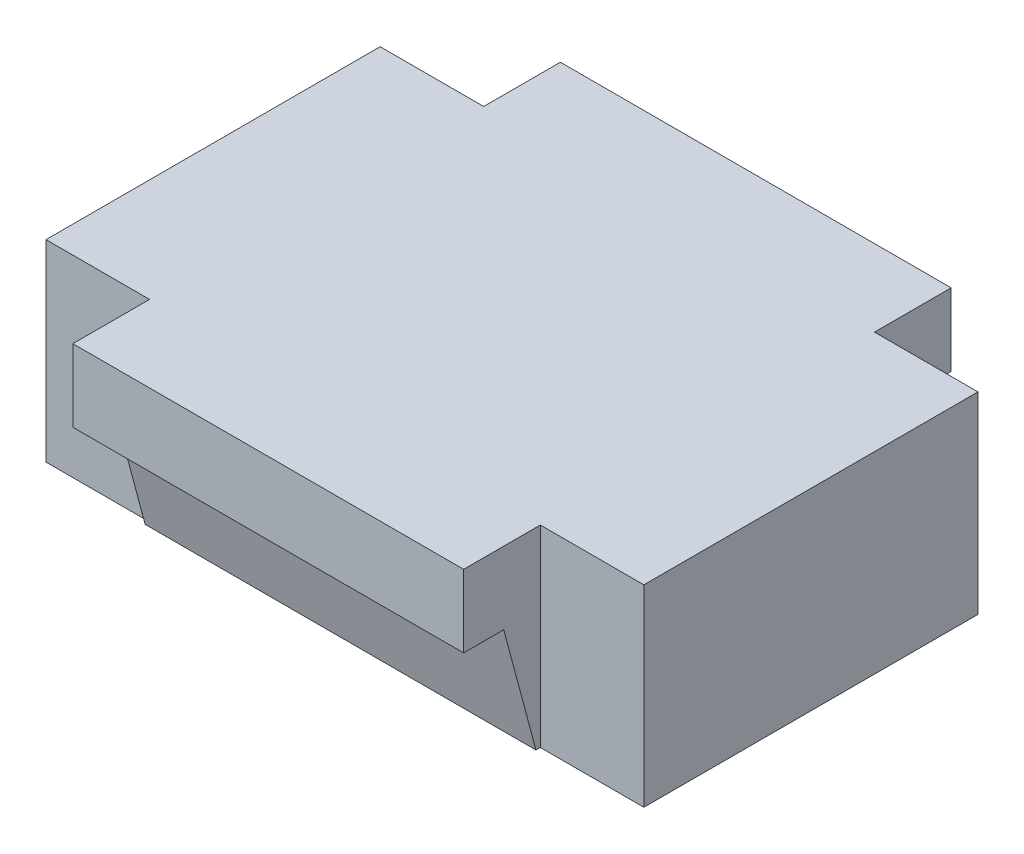
ISO-10303-21;
HEADER;
FILE_DESCRIPTION(('STEP AP214'),'2;1');
FILE_NAME('part.step','',(''),(''),'','','');
FILE_SCHEMA(('AUTOMOTIVE_DESIGN { 1 0 10303 214 1 1 1 1 }'));
ENDSEC;
DATA;
#1=APPLICATION_CONTEXT('core data for automotive mechanical design processes');
#2=APPLICATION_PROTOCOL_DEFINITION('international standard','automotive_design',2000,#1);
#3=PRODUCT_CONTEXT('',#1,'mechanical');
#4=PRODUCT('Part','Part','',(#3));
#5=PRODUCT_RELATED_PRODUCT_CATEGORY('part','',(#4));
#6=PRODUCT_DEFINITION_FORMATION('','',#4);
#7=PRODUCT_DEFINITION_CONTEXT('part definition',#1,'design');
#8=PRODUCT_DEFINITION('design','',#6,#7);
#9=PRODUCT_DEFINITION_SHAPE('','',#8);
#10=(LENGTH_UNIT() NAMED_UNIT(*) SI_UNIT(.MILLI.,.METRE.));
#11=(NAMED_UNIT(*) PLANE_ANGLE_UNIT() SI_UNIT($,.RADIAN.));
#12=(NAMED_UNIT(*) SI_UNIT($,.STERADIAN.) SOLID_ANGLE_UNIT());
#13=UNCERTAINTY_MEASURE_WITH_UNIT(LENGTH_MEASURE(1.E-05),#10,'distance_accuracy_value','');
#14=(GEOMETRIC_REPRESENTATION_CONTEXT(3) GLOBAL_UNCERTAINTY_ASSIGNED_CONTEXT((#13)) GLOBAL_UNIT_ASSIGNED_CONTEXT((#10,
#11,#12)) REPRESENTATION_CONTEXT('',''));
#15=CARTESIAN_POINT('',(0.,0.,0.));
#16=DIRECTION('',(0.,0.,1.));
#17=DIRECTION('',(1.,0.,0.));
#18=AXIS2_PLACEMENT_3D('',#15,#16,#17);
#19=CARTESIAN_POINT('',(25.25,2.66144660940672,9.64644660940669));
#20=DIRECTION('',(1.,0.,0.));
#21=DIRECTION('',(0.,0.,-1.));
#22=AXIS2_PLACEMENT_3D('',#19,#20,#21);
#23=PLANE('',#22);
#24=DIRECTION('',(0.,1.,0.));
#25=VECTOR('',#24,1.);
#26=CARTESIAN_POINT('',(25.25,14.03,-21.59));
#27=LINE('',#26,#25);
#28=CARTESIAN_POINT('',(25.25,-8.9,-21.59));
#29=VERTEX_POINT('',#28);
#30=CARTESIAN_POINT('',(25.25,16.,-21.59));
#31=VERTEX_POINT('',#30);
#32=EDGE_CURVE('E67',#29,#31,#27,.T.);
#33=ORIENTED_EDGE('',*,*,#32,.F.);
#34=DIRECTION('',(0.,0.,1.));
#35=VECTOR('',#34,1.);
#36=CARTESIAN_POINT('',(25.25,-8.9,-20.12));
#37=LINE('',#36,#35);
#38=CARTESIAN_POINT('',(25.25,-8.9,-22.1552761804101));
#39=VERTEX_POINT('',#38);
#40=EDGE_CURVE('E263',#39,#29,#37,.T.);
#41=ORIENTED_EDGE('',*,*,#40,.F.);
#42=DIRECTION('',(0.,-0.965925826289069,0.258819045102518));
#43=VECTOR('',#42,1.);
#44=CARTESIAN_POINT('',(25.25,-7.4857864376269,-22.5342135623731));
#45=LINE('',#44,#43);
#46=CARTESIAN_POINT('',(25.25,6.6442135623731,-26.3203356514248));
#47=VERTEX_POINT('',#46);
#48=EDGE_CURVE('E248',#47,#39,#45,.T.);
#49=ORIENTED_EDGE('',*,*,#48,.F.);
#50=DIRECTION('',(0.,0.,1.));
#51=VECTOR('',#50,1.);
#52=CARTESIAN_POINT('',(25.25,6.6442135623731,-26.3203356514248));
#53=LINE('',#52,#51);
#54=CARTESIAN_POINT('',(25.25,6.6442135623731,-31.5));
#55=VERTEX_POINT('',#54);
#56=EDGE_CURVE('E253',#55,#47,#53,.T.);
#57=ORIENTED_EDGE('',*,*,#56,.F.);
#58=DIRECTION('',(0.,-1.,0.));
#59=VECTOR('',#58,1.);
#60=CARTESIAN_POINT('',(25.25,6.6442135623731,-31.5));
#61=LINE('',#60,#59);
#62=CARTESIAN_POINT('',(25.25,16.,-31.5));
#63=VERTEX_POINT('',#62);
#64=EDGE_CURVE('E257',#63,#55,#61,.T.);
#65=ORIENTED_EDGE('',*,*,#64,.F.);
#66=DIRECTION('',(0.,0.,1.));
#67=VECTOR('',#66,1.);
#68=CARTESIAN_POINT('',(25.25,16.,5.35500000000001));
#69=LINE('',#68,#67);
#70=EDGE_CURVE('E291',#63,#31,#69,.T.);
#71=ORIENTED_EDGE('',*,*,#70,.T.);
#72=EDGE_LOOP('',(#33,#41,#49,#57,#65,#71));
#73=FACE_BOUND('',#72,.T.);
#74=ADVANCED_FACE('F43',(#73),#23,.T.);
#75=CARTESIAN_POINT('',(-25.25,2.66144660940672,9.64644660940669));
#76=DIRECTION('',(-1.,0.,0.));
#77=DIRECTION('',(0.,0.,-1.));
#78=AXIS2_PLACEMENT_3D('',#75,#76,#77);
#79=PLANE('',#78);
#80=DIRECTION('',(0.,1.,0.));
#81=VECTOR('',#80,1.);
#82=CARTESIAN_POINT('',(-25.25,14.03,-21.59));
#83=LINE('',#82,#81);
#84=CARTESIAN_POINT('',(-25.25,-8.9,-21.59));
#85=VERTEX_POINT('',#84);
#86=CARTESIAN_POINT('',(-25.25,16.,-21.59));
#87=VERTEX_POINT('',#86);
#88=EDGE_CURVE('E184',#85,#87,#83,.T.);
#89=ORIENTED_EDGE('',*,*,#88,.T.);
#90=DIRECTION('',(0.,0.,1.));
#91=VECTOR('',#90,1.);
#92=CARTESIAN_POINT('',(-25.25,16.,5.35500000000001));
#93=LINE('',#92,#91);
#94=CARTESIAN_POINT('',(-25.25,16.,-31.5));
#95=VERTEX_POINT('',#94);
#96=EDGE_CURVE('E236',#95,#87,#93,.T.);
#97=ORIENTED_EDGE('',*,*,#96,.F.);
#98=DIRECTION('',(0.,-1.,0.));
#99=VECTOR('',#98,1.);
#100=CARTESIAN_POINT('',(-25.25,6.6442135623731,-31.5));
#101=LINE('',#100,#99);
#102=CARTESIAN_POINT('',(-25.25,6.6442135623731,-31.5));
#103=VERTEX_POINT('',#102);
#104=EDGE_CURVE('E217',#95,#103,#101,.T.);
#105=ORIENTED_EDGE('',*,*,#104,.T.);
#106=DIRECTION('',(0.,0.,1.));
#107=VECTOR('',#106,1.);
#108=CARTESIAN_POINT('',(-25.25,6.6442135623731,-26.3203356514248));
#109=LINE('',#108,#107);
#110=CARTESIAN_POINT('',(-25.25,6.6442135623731,-26.3203356514248));
#111=VERTEX_POINT('',#110);
#112=EDGE_CURVE('E213',#103,#111,#109,.T.);
#113=ORIENTED_EDGE('',*,*,#112,.T.);
#114=DIRECTION('',(0.,-0.965925826289069,0.258819045102518));
#115=VECTOR('',#114,1.);
#116=CARTESIAN_POINT('',(-25.25,-7.4857864376269,-22.5342135623731));
#117=LINE('',#116,#115);
#118=CARTESIAN_POINT('',(-25.25,-8.9,-22.1552761804101));
#119=VERTEX_POINT('',#118);
#120=EDGE_CURVE('E181',#111,#119,#117,.T.);
#121=ORIENTED_EDGE('',*,*,#120,.T.);
#122=DIRECTION('',(0.,0.,1.));
#123=VECTOR('',#122,1.);
#124=CARTESIAN_POINT('',(-25.25,-8.9,-20.12));
#125=LINE('',#124,#123);
#126=EDGE_CURVE('E206',#119,#85,#125,.T.);
#127=ORIENTED_EDGE('',*,*,#126,.T.);
#128=EDGE_LOOP('',(#89,#97,#105,#113,#121,#127));
#129=FACE_BOUND('',#128,.T.);
#130=ADVANCED_FACE('F338',(#129),#79,.T.);
#131=CARTESIAN_POINT('',(38.63,-7.43,21.59));
#132=DIRECTION('',(0.,0.,-1.));
#133=DIRECTION('',(0.,1.,0.));
#134=AXIS2_PLACEMENT_3D('',#131,#132,#133);
#135=PLANE('',#134);
#136=DIRECTION('',(0.,-1.,0.));
#137=VECTOR('',#136,1.);
#138=CARTESIAN_POINT('',(38.63,-7.43,21.59));
#139=LINE('',#138,#137);
#140=CARTESIAN_POINT('',(38.63,16.,21.59));
#141=VERTEX_POINT('',#140);
#142=CARTESIAN_POINT('',(38.63,-8.9,21.59));
#143=VERTEX_POINT('',#142);
#144=EDGE_CURVE('E52',#141,#143,#139,.T.);
#145=ORIENTED_EDGE('',*,*,#144,.F.);
#146=DIRECTION('',(1.,0.,0.));
#147=VECTOR('',#146,1.);
#148=CARTESIAN_POINT('',(-88.4749836994657,16.,21.59));
#149=LINE('',#148,#147);
#150=CARTESIAN_POINT('',(25.25,16.,21.59));
#151=VERTEX_POINT('',#150);
#152=EDGE_CURVE('E324',#151,#141,#149,.T.);
#153=ORIENTED_EDGE('',*,*,#152,.F.);
#154=DIRECTION('',(0.,1.,0.));
#155=VECTOR('',#154,1.);
#156=CARTESIAN_POINT('',(25.25,14.03,21.59));
#157=LINE('',#156,#155);
#158=CARTESIAN_POINT('',(25.25,-8.9,21.59));
#159=VERTEX_POINT('',#158);
#160=EDGE_CURVE('E59',#159,#151,#157,.T.);
#161=ORIENTED_EDGE('',*,*,#160,.F.);
#162=DIRECTION('',(1.,0.,0.));
#163=VECTOR('',#162,1.);
#164=CARTESIAN_POINT('',(-88.4749836994657,-8.9,21.59));
#165=LINE('',#164,#163);
#166=EDGE_CURVE('E201',#159,#143,#165,.T.);
#167=ORIENTED_EDGE('',*,*,#166,.T.);
#168=EDGE_LOOP('',(#145,#153,#161,#167));
#169=FACE_BOUND('',#168,.T.);
#170=ADVANCED_FACE('F45',(#169),#135,.F.);
#171=CARTESIAN_POINT('',(38.63,-8.9,8.23500000000003));
#172=DIRECTION('',(0.,1.,0.));
#173=DIRECTION('',(0.,0.,1.));
#174=AXIS2_PLACEMENT_3D('',#171,#172,#173);
#175=PLANE('',#174);
#176=DIRECTION('',(0.,0.,-1.));
#177=VECTOR('',#176,1.);
#178=CARTESIAN_POINT('',(-25.25,-8.9,20.12));
#179=LINE('',#178,#177);
#180=CARTESIAN_POINT('',(-25.25,-8.90000000000001,22.1552761804101));
#181=VERTEX_POINT('',#180);
#182=CARTESIAN_POINT('',(-25.25,-8.9,21.59));
#183=VERTEX_POINT('',#182);
#184=EDGE_CURVE('E180',#181,#183,#179,.T.);
#185=ORIENTED_EDGE('',*,*,#184,.T.);
#186=CARTESIAN_POINT('',(-38.63,-8.9,21.59));
#187=VERTEX_POINT('',#186);
#188=EDGE_CURVE('E164',#187,#183,#165,.T.);
#189=ORIENTED_EDGE('',*,*,#188,.F.);
#190=DIRECTION('',(0.,0.,-1.));
#191=VECTOR('',#190,1.);
#192=CARTESIAN_POINT('',(-38.63,-8.9,8.23500000000003));
#193=LINE('',#192,#191);
#194=CARTESIAN_POINT('',(-38.63,-8.9,-21.59));
#195=VERTEX_POINT('',#194);
#196=EDGE_CURVE('E157',#187,#195,#193,.T.);
#197=ORIENTED_EDGE('',*,*,#196,.T.);
#198=DIRECTION('',(1.,0.,0.));
#199=VECTOR('',#198,1.);
#200=CARTESIAN_POINT('',(-88.4749836994657,-8.9,-21.59));
#201=LINE('',#200,#199);
#202=EDGE_CURVE('E162',#195,#85,#201,.T.);
#203=ORIENTED_EDGE('',*,*,#202,.T.);
#204=ORIENTED_EDGE('',*,*,#126,.F.);
#205=DIRECTION('',(1.,0.,0.));
#206=VECTOR('',#205,1.);
#207=CARTESIAN_POINT('',(-92.9922320270007,-8.9,-22.1552761804101));
#208=LINE('',#207,#206);
#209=EDGE_CURVE('E202',#119,#39,#208,.T.);
#210=ORIENTED_EDGE('',*,*,#209,.T.);
#211=ORIENTED_EDGE('',*,*,#40,.T.);
#212=CARTESIAN_POINT('',(38.63,-8.9,-21.59));
#213=VERTEX_POINT('',#212);
#214=EDGE_CURVE('E188',#29,#213,#201,.T.);
#215=ORIENTED_EDGE('',*,*,#214,.T.);
#216=DIRECTION('',(0.,0.,-1.));
#217=VECTOR('',#216,1.);
#218=CARTESIAN_POINT('',(38.63,-8.9,8.23500000000003));
#219=LINE('',#218,#217);
#220=EDGE_CURVE('E12',#143,#213,#219,.T.);
#221=ORIENTED_EDGE('',*,*,#220,.F.);
#222=ORIENTED_EDGE('',*,*,#166,.F.);
#223=DIRECTION('',(0.,0.,-1.));
#224=VECTOR('',#223,1.);
#225=CARTESIAN_POINT('',(25.25,-8.9,20.12));
#226=LINE('',#225,#224);
#227=CARTESIAN_POINT('',(25.25,-8.90000000000001,22.1552761804101));
#228=VERTEX_POINT('',#227);
#229=EDGE_CURVE('E297',#228,#159,#226,.T.);
#230=ORIENTED_EDGE('',*,*,#229,.F.);
#231=DIRECTION('',(1.,0.,0.));
#232=VECTOR('',#231,1.);
#233=CARTESIAN_POINT('',(-92.9922320270007,-8.90000000000001,22.1552761804101));
#234=LINE('',#233,#232);
#235=EDGE_CURVE('E200',#181,#228,#234,.T.);
#236=ORIENTED_EDGE('',*,*,#235,.F.);
#237=EDGE_LOOP('',(#185,#189,#197,#203,#204,#210,#211,#215,#221,#222,#230,#236));
#238=FACE_BOUND('',#237,.T.);
#239=ADVANCED_FACE('F160',(#238),#175,.F.);
#240=CARTESIAN_POINT('',(38.63,2.66144660940672,9.64644660940669));
#241=DIRECTION('',(1.,0.,0.));
#242=DIRECTION('',(0.,0.,-1.));
#243=AXIS2_PLACEMENT_3D('',#240,#241,#242);
#244=PLANE('',#243);
#245=DIRECTION('',(0.,0.,1.));
#246=VECTOR('',#245,1.);
#247=CARTESIAN_POINT('',(38.63,16.,21.59));
#248=LINE('',#247,#246);
#249=CARTESIAN_POINT('',(38.63,16.,-21.59));
#250=VERTEX_POINT('',#249);
#251=EDGE_CURVE('E195',#250,#141,#248,.T.);
#252=ORIENTED_EDGE('',*,*,#251,.T.);
#253=ORIENTED_EDGE('',*,*,#144,.T.);
#254=ORIENTED_EDGE('',*,*,#220,.T.);
#255=DIRECTION('',(0.,-1.,0.));
#256=VECTOR('',#255,1.);
#257=CARTESIAN_POINT('',(38.63,-7.43,-21.59));
#258=LINE('',#257,#256);
#259=EDGE_CURVE('E252',#250,#213,#258,.T.);
#260=ORIENTED_EDGE('',*,*,#259,.F.);
#261=EDGE_LOOP('',(#252,#253,#254,#260));
#262=FACE_BOUND('',#261,.T.);
#263=ADVANCED_FACE('F313',(#262),#244,.T.);
#264=CARTESIAN_POINT('',(78.7829575498493,16.,5.35500000000001));
#265=DIRECTION('',(0.,-1.,0.));
#266=DIRECTION('',(0.,0.,-1.));
#267=AXIS2_PLACEMENT_3D('',#264,#265,#266);
#268=PLANE('',#267);
#269=CARTESIAN_POINT('',(25.25,16.,31.5));
#270=VERTEX_POINT('',#269);
#271=EDGE_CURVE('E294',#151,#270,#69,.T.);
#272=ORIENTED_EDGE('',*,*,#271,.F.);
#273=ORIENTED_EDGE('',*,*,#152,.T.);
#274=ORIENTED_EDGE('',*,*,#251,.F.);
#275=DIRECTION('',(1.,0.,0.));
#276=VECTOR('',#275,1.);
#277=CARTESIAN_POINT('',(-88.4749836994657,16.,-21.59));
#278=LINE('',#277,#276);
#279=EDGE_CURVE('E187',#31,#250,#278,.T.);
#280=ORIENTED_EDGE('',*,*,#279,.F.);
#281=ORIENTED_EDGE('',*,*,#70,.F.);
#282=DIRECTION('',(-1.,0.,0.));
#283=VECTOR('',#282,1.);
#284=CARTESIAN_POINT('',(78.7829575498493,16.,-31.5));
#285=LINE('',#284,#283);
#286=EDGE_CURVE('E168',#63,#95,#285,.T.);
#287=ORIENTED_EDGE('',*,*,#286,.T.);
#288=ORIENTED_EDGE('',*,*,#96,.T.);
#289=CARTESIAN_POINT('',(-38.63,16.,-21.59));
#290=VERTEX_POINT('',#289);
#291=EDGE_CURVE('E192',#290,#87,#278,.T.);
#292=ORIENTED_EDGE('',*,*,#291,.F.);
#293=DIRECTION('',(0.,0.,1.));
#294=VECTOR('',#293,1.);
#295=CARTESIAN_POINT('',(-38.63,16.,21.59));
#296=LINE('',#295,#294);
#297=CARTESIAN_POINT('',(-38.63,16.,21.59));
#298=VERTEX_POINT('',#297);
#299=EDGE_CURVE('E175',#290,#298,#296,.T.);
#300=ORIENTED_EDGE('',*,*,#299,.T.);
#301=CARTESIAN_POINT('',(-25.25,16.,21.59));
#302=VERTEX_POINT('',#301);
#303=EDGE_CURVE('E321',#298,#302,#149,.T.);
#304=ORIENTED_EDGE('',*,*,#303,.T.);
#305=CARTESIAN_POINT('',(-25.25,16.,31.5));
#306=VERTEX_POINT('',#305);
#307=EDGE_CURVE('E240',#302,#306,#93,.T.);
#308=ORIENTED_EDGE('',*,*,#307,.T.);
#309=DIRECTION('',(-1.,0.,0.));
#310=VECTOR('',#309,1.);
#311=CARTESIAN_POINT('',(78.7829575498493,16.,31.5));
#312=LINE('',#311,#310);
#313=EDGE_CURVE('E279',#270,#306,#312,.T.);
#314=ORIENTED_EDGE('',*,*,#313,.F.);
#315=EDGE_LOOP('',(#272,#273,#274,#280,#281,#287,#288,#292,#300,#304,#308,#314));
#316=FACE_BOUND('',#315,.T.);
#317=ADVANCED_FACE('F334',(#316),#268,.F.);
#318=CARTESIAN_POINT('',(78.7829575498493,6.6442135623731,31.5));
#319=DIRECTION('',(0.,0.,-1.));
#320=DIRECTION('',(-1.,0.,0.));
#321=AXIS2_PLACEMENT_3D('',#318,#319,#320);
#322=PLANE('',#321);
#323=DIRECTION('',(0.,-1.,0.));
#324=VECTOR('',#323,1.);
#325=CARTESIAN_POINT('',(25.25,6.6442135623731,31.5));
#326=LINE('',#325,#324);
#327=CARTESIAN_POINT('',(25.25,6.6442135623731,31.5));
#328=VERTEX_POINT('',#327);
#329=EDGE_CURVE('E287',#270,#328,#326,.T.);
#330=ORIENTED_EDGE('',*,*,#329,.F.);
#331=ORIENTED_EDGE('',*,*,#313,.T.);
#332=DIRECTION('',(0.,-1.,0.));
#333=VECTOR('',#332,1.);
#334=CARTESIAN_POINT('',(-25.25,6.6442135623731,31.5));
#335=LINE('',#334,#333);
#336=CARTESIAN_POINT('',(-25.25,6.6442135623731,31.5));
#337=VERTEX_POINT('',#336);
#338=EDGE_CURVE('E232',#306,#337,#335,.T.);
#339=ORIENTED_EDGE('',*,*,#338,.T.);
#340=DIRECTION('',(-1.,0.,0.));
#341=VECTOR('',#340,1.);
#342=CARTESIAN_POINT('',(78.7829575498493,6.6442135623731,31.5));
#343=LINE('',#342,#341);
#344=EDGE_CURVE('E304',#328,#337,#343,.T.);
#345=ORIENTED_EDGE('',*,*,#344,.F.);
#346=EDGE_LOOP('',(#330,#331,#339,#345));
#347=FACE_BOUND('',#346,.T.);
#348=ADVANCED_FACE('F356',(#347),#322,.F.);
#349=CARTESIAN_POINT('',(78.7829575498493,6.6442135623731,26.3203356514248));
#350=DIRECTION('',(0.,1.,0.));
#351=DIRECTION('',(0.,0.,1.));
#352=AXIS2_PLACEMENT_3D('',#349,#350,#351);
#353=PLANE('',#352);
#354=DIRECTION('',(0.,0.,-1.));
#355=VECTOR('',#354,1.);
#356=CARTESIAN_POINT('',(25.25,6.6442135623731,26.3203356514248));
#357=LINE('',#356,#355);
#358=CARTESIAN_POINT('',(25.25,6.6442135623731,26.3203356514248));
#359=VERTEX_POINT('',#358);
#360=EDGE_CURVE('E283',#328,#359,#357,.T.);
#361=ORIENTED_EDGE('',*,*,#360,.F.);
#362=ORIENTED_EDGE('',*,*,#344,.T.);
#363=DIRECTION('',(0.,0.,-1.));
#364=VECTOR('',#363,1.);
#365=CARTESIAN_POINT('',(-25.25,6.6442135623731,26.3203356514248));
#366=LINE('',#365,#364);
#367=CARTESIAN_POINT('',(-25.25,6.6442135623731,26.3203356514248));
#368=VERTEX_POINT('',#367);
#369=EDGE_CURVE('E228',#337,#368,#366,.T.);
#370=ORIENTED_EDGE('',*,*,#369,.T.);
#371=DIRECTION('',(-1.,0.,0.));
#372=VECTOR('',#371,1.);
#373=CARTESIAN_POINT('',(78.7829575498493,6.6442135623731,26.3203356514248));
#374=LINE('',#373,#372);
#375=EDGE_CURVE('E300',#359,#368,#374,.T.);
#376=ORIENTED_EDGE('',*,*,#375,.F.);
#377=EDGE_LOOP('',(#361,#362,#370,#376));
#378=FACE_BOUND('',#377,.T.);
#379=ADVANCED_FACE('F364',(#378),#353,.F.);
#380=CARTESIAN_POINT('',(78.7829575498493,-7.4857864376269,22.5342135623731));
#381=DIRECTION('',(0.,0.258819045102518,-0.965925826289069));
#382=DIRECTION('',(0.,0.965925826289069,0.258819045102518));
#383=AXIS2_PLACEMENT_3D('',#380,#381,#382);
#384=PLANE('',#383);
#385=DIRECTION('',(0.,-0.965925826289069,-0.258819045102518));
#386=VECTOR('',#385,1.);
#387=CARTESIAN_POINT('',(25.25,-7.4857864376269,22.5342135623731));
#388=LINE('',#387,#386);
#389=EDGE_CURVE('E280',#359,#228,#388,.T.);
#390=ORIENTED_EDGE('',*,*,#389,.F.);
#391=ORIENTED_EDGE('',*,*,#375,.T.);
#392=DIRECTION('',(0.,-0.965925826289069,-0.258819045102518));
#393=VECTOR('',#392,1.);
#394=CARTESIAN_POINT('',(-25.25,-7.4857864376269,22.5342135623731));
#395=LINE('',#394,#393);
#396=EDGE_CURVE('E225',#368,#181,#395,.T.);
#397=ORIENTED_EDGE('',*,*,#396,.T.);
#398=ORIENTED_EDGE('',*,*,#235,.T.);
#399=EDGE_LOOP('',(#390,#391,#397,#398));
#400=FACE_BOUND('',#399,.T.);
#401=ADVANCED_FACE('F368',(#400),#384,.F.);
#402=ORIENTED_EDGE('',*,*,#160,.T.);
#403=ORIENTED_EDGE('',*,*,#271,.T.);
#404=ORIENTED_EDGE('',*,*,#329,.T.);
#405=ORIENTED_EDGE('',*,*,#360,.T.);
#406=ORIENTED_EDGE('',*,*,#389,.T.);
#407=ORIENTED_EDGE('',*,*,#229,.T.);
#408=EDGE_LOOP('',(#402,#403,#404,#405,#406,#407));
#409=FACE_BOUND('',#408,.T.);
#410=ADVANCED_FACE('F365',(#409),#23,.T.);
#411=CARTESIAN_POINT('',(38.63,-7.43,-21.59));
#412=DIRECTION('',(0.,0.,1.));
#413=DIRECTION('',(0.,1.,0.));
#414=AXIS2_PLACEMENT_3D('',#411,#412,#413);
#415=PLANE('',#414);
#416=ORIENTED_EDGE('',*,*,#32,.T.);
#417=ORIENTED_EDGE('',*,*,#279,.T.);
#418=ORIENTED_EDGE('',*,*,#259,.T.);
#419=ORIENTED_EDGE('',*,*,#214,.F.);
#420=EDGE_LOOP('',(#416,#417,#418,#419));
#421=FACE_BOUND('',#420,.T.);
#422=ADVANCED_FACE('F348',(#421),#415,.F.);
#423=CARTESIAN_POINT('',(78.7829575498493,6.6442135623731,-31.5));
#424=DIRECTION('',(0.,0.,1.));
#425=DIRECTION('',(-1.,0.,0.));
#426=AXIS2_PLACEMENT_3D('',#423,#424,#425);
#427=PLANE('',#426);
#428=ORIENTED_EDGE('',*,*,#64,.T.);
#429=DIRECTION('',(-1.,0.,0.));
#430=VECTOR('',#429,1.);
#431=CARTESIAN_POINT('',(78.7829575498493,6.6442135623731,-31.5));
#432=LINE('',#431,#430);
#433=EDGE_CURVE('E271',#55,#103,#432,.T.);
#434=ORIENTED_EDGE('',*,*,#433,.T.);
#435=ORIENTED_EDGE('',*,*,#104,.F.);
#436=ORIENTED_EDGE('',*,*,#286,.F.);
#437=EDGE_LOOP('',(#428,#434,#435,#436));
#438=FACE_BOUND('',#437,.T.);
#439=ADVANCED_FACE('F393',(#438),#427,.F.);
#440=CARTESIAN_POINT('',(78.7829575498493,6.6442135623731,-26.3203356514248));
#441=DIRECTION('',(0.,1.,0.));
#442=DIRECTION('',(0.,0.,-1.));
#443=AXIS2_PLACEMENT_3D('',#440,#441,#442);
#444=PLANE('',#443);
#445=ORIENTED_EDGE('',*,*,#56,.T.);
#446=DIRECTION('',(-1.,0.,0.));
#447=VECTOR('',#446,1.);
#448=CARTESIAN_POINT('',(78.7829575498493,6.6442135623731,-26.3203356514248));
#449=LINE('',#448,#447);
#450=EDGE_CURVE('E267',#47,#111,#449,.T.);
#451=ORIENTED_EDGE('',*,*,#450,.T.);
#452=ORIENTED_EDGE('',*,*,#112,.F.);
#453=ORIENTED_EDGE('',*,*,#433,.F.);
#454=EDGE_LOOP('',(#445,#451,#452,#453));
#455=FACE_BOUND('',#454,.T.);
#456=ADVANCED_FACE('F378',(#455),#444,.F.);
#457=CARTESIAN_POINT('',(78.7829575498493,-7.4857864376269,-22.5342135623731));
#458=DIRECTION('',(0.,0.258819045102518,0.965925826289069));
#459=DIRECTION('',(0.,0.965925826289069,-0.258819045102518));
#460=AXIS2_PLACEMENT_3D('',#457,#458,#459);
#461=PLANE('',#460);
#462=ORIENTED_EDGE('',*,*,#48,.T.);
#463=ORIENTED_EDGE('',*,*,#209,.F.);
#464=ORIENTED_EDGE('',*,*,#120,.F.);
#465=ORIENTED_EDGE('',*,*,#450,.F.);
#466=EDGE_LOOP('',(#462,#463,#464,#465));
#467=FACE_BOUND('',#466,.T.);
#468=ADVANCED_FACE('F342',(#467),#461,.F.);
#469=CARTESIAN_POINT('',(-38.63,-7.43,21.59));
#470=DIRECTION('',(0.,0.,-1.));
#471=DIRECTION('',(0.,1.,0.));
#472=AXIS2_PLACEMENT_3D('',#469,#470,#471);
#473=PLANE('',#472);
#474=DIRECTION('',(0.,1.,0.));
#475=VECTOR('',#474,1.);
#476=CARTESIAN_POINT('',(-25.25,14.03,21.59));
#477=LINE('',#476,#475);
#478=EDGE_CURVE('E241',#183,#302,#477,.T.);
#479=ORIENTED_EDGE('',*,*,#478,.T.);
#480=ORIENTED_EDGE('',*,*,#303,.F.);
#481=DIRECTION('',(0.,-1.,0.));
#482=VECTOR('',#481,1.);
#483=CARTESIAN_POINT('',(-38.63,-7.43,21.59));
#484=LINE('',#483,#482);
#485=EDGE_CURVE('E169',#298,#187,#484,.T.);
#486=ORIENTED_EDGE('',*,*,#485,.T.);
#487=ORIENTED_EDGE('',*,*,#188,.T.);
#488=EDGE_LOOP('',(#479,#480,#486,#487));
#489=FACE_BOUND('',#488,.T.);
#490=ADVANCED_FACE('F370',(#489),#473,.F.);
#491=CARTESIAN_POINT('',(-38.63,2.66144660940672,9.64644660940669));
#492=DIRECTION('',(-1.,0.,0.));
#493=DIRECTION('',(0.,0.,-1.));
#494=AXIS2_PLACEMENT_3D('',#491,#492,#493);
#495=PLANE('',#494);
#496=ORIENTED_EDGE('',*,*,#485,.F.);
#497=ORIENTED_EDGE('',*,*,#299,.F.);
#498=DIRECTION('',(0.,-1.,0.));
#499=VECTOR('',#498,1.);
#500=CARTESIAN_POINT('',(-38.63,-7.43,-21.59));
#501=LINE('',#500,#499);
#502=EDGE_CURVE('E172',#290,#195,#501,.T.);
#503=ORIENTED_EDGE('',*,*,#502,.T.);
#504=ORIENTED_EDGE('',*,*,#196,.F.);
#505=EDGE_LOOP('',(#496,#497,#503,#504));
#506=FACE_BOUND('',#505,.T.);
#507=ADVANCED_FACE('F173',(#506),#495,.T.);
#508=ORIENTED_EDGE('',*,*,#478,.F.);
#509=ORIENTED_EDGE('',*,*,#184,.F.);
#510=ORIENTED_EDGE('',*,*,#396,.F.);
#511=ORIENTED_EDGE('',*,*,#369,.F.);
#512=ORIENTED_EDGE('',*,*,#338,.F.);
#513=ORIENTED_EDGE('',*,*,#307,.F.);
#514=EDGE_LOOP('',(#508,#509,#510,#511,#512,#513));
#515=FACE_BOUND('',#514,.T.);
#516=ADVANCED_FACE('F359',(#515),#79,.T.);
#517=CARTESIAN_POINT('',(-38.63,-7.43,-21.59));
#518=DIRECTION('',(0.,0.,1.));
#519=DIRECTION('',(0.,1.,0.));
#520=AXIS2_PLACEMENT_3D('',#517,#518,#519);
#521=PLANE('',#520);
#522=ORIENTED_EDGE('',*,*,#502,.F.);
#523=ORIENTED_EDGE('',*,*,#291,.T.);
#524=ORIENTED_EDGE('',*,*,#88,.F.);
#525=ORIENTED_EDGE('',*,*,#202,.F.);
#526=EDGE_LOOP('',(#522,#523,#524,#525));
#527=FACE_BOUND('',#526,.T.);
#528=ADVANCED_FACE('F183',(#527),#521,.F.);
#529=CLOSED_SHELL('',(#74,#130,#170,#239,#263,#317,#348,#379,#401,#410,#422,#439,#456,#468,#490,
#507,#516,#528));
#530=MANIFOLD_SOLID_BREP('B2',#529);
#531=ADVANCED_BREP_SHAPE_REPRESENTATION('',(#18,#530),#14);
#532=SHAPE_DEFINITION_REPRESENTATION(#9,#531);
ENDSEC;
END-ISO-10303-21;
